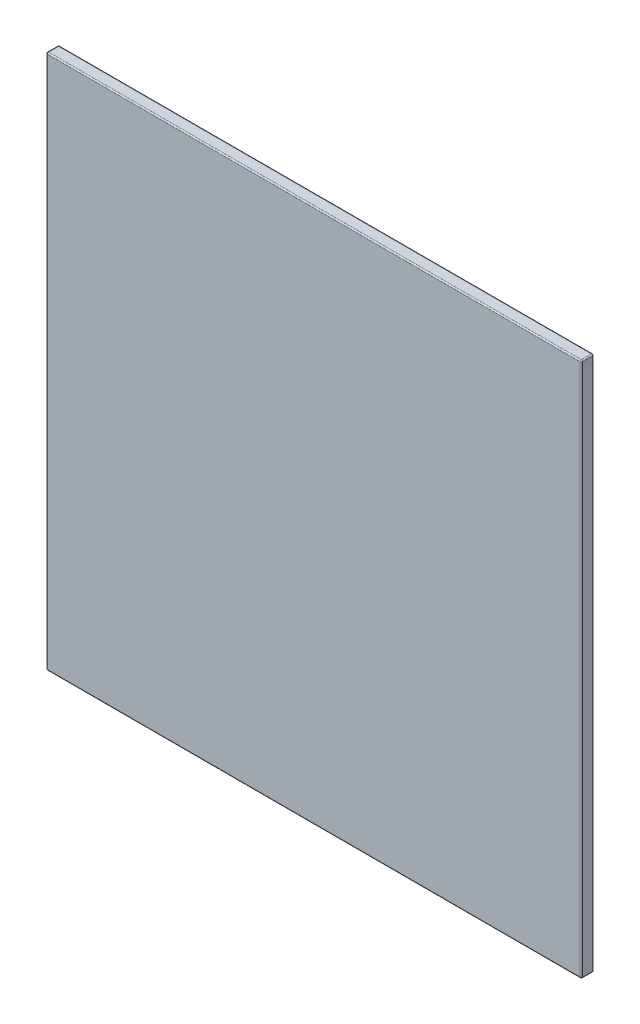
ISO-10303-21;
HEADER;
FILE_DESCRIPTION(('STEP AP214'),'2;1');
FILE_NAME('part.step','',(''),(''),'','','');
FILE_SCHEMA(('AUTOMOTIVE_DESIGN { 1 0 10303 214 1 1 1 1 }'));
ENDSEC;
DATA;
#1=APPLICATION_CONTEXT('core data for automotive mechanical design processes');
#2=APPLICATION_PROTOCOL_DEFINITION('international standard','automotive_design',2000,#1);
#3=PRODUCT_CONTEXT('',#1,'mechanical');
#4=PRODUCT('Part','Part','',(#3));
#5=PRODUCT_RELATED_PRODUCT_CATEGORY('part','',(#4));
#6=PRODUCT_DEFINITION_FORMATION('','',#4);
#7=PRODUCT_DEFINITION_CONTEXT('part definition',#1,'design');
#8=PRODUCT_DEFINITION('design','',#6,#7);
#9=PRODUCT_DEFINITION_SHAPE('','',#8);
#10=(LENGTH_UNIT() NAMED_UNIT(*) SI_UNIT(.MILLI.,.METRE.));
#11=(NAMED_UNIT(*) PLANE_ANGLE_UNIT() SI_UNIT($,.RADIAN.));
#12=(NAMED_UNIT(*) SI_UNIT($,.STERADIAN.) SOLID_ANGLE_UNIT());
#13=UNCERTAINTY_MEASURE_WITH_UNIT(LENGTH_MEASURE(1.E-05),#10,'distance_accuracy_value','');
#14=(GEOMETRIC_REPRESENTATION_CONTEXT(3) GLOBAL_UNCERTAINTY_ASSIGNED_CONTEXT((#13)) GLOBAL_UNIT_ASSIGNED_CONTEXT((#10,
#11,#12)) REPRESENTATION_CONTEXT('',''));
#15=CARTESIAN_POINT('',(0.,0.,0.));
#16=DIRECTION('',(0.,0.,1.));
#17=DIRECTION('',(1.,0.,0.));
#18=AXIS2_PLACEMENT_3D('',#15,#16,#17);
#19=CARTESIAN_POINT('',(126.708074534162,233.385093167702,7.));
#20=DIRECTION('',(-1.,0.,0.));
#21=DIRECTION('',(0.,-1.,0.));
#22=AXIS2_PLACEMENT_3D('',#19,#20,#21);
#23=PLANE('',#22);
#24=DIRECTION('',(0.,1.,0.));
#25=VECTOR('',#24,1.);
#26=CARTESIAN_POINT('',(126.708074534162,233.385093167702,0.7));
#27=LINE('',#26,#25);
#28=CARTESIAN_POINT('',(126.708074534162,-65.9149068322982,0.7));
#29=VERTEX_POINT('',#28);
#30=CARTESIAN_POINT('',(126.708074534162,232.685093167702,0.7));
#31=VERTEX_POINT('',#30);
#32=EDGE_CURVE('E166',#29,#31,#27,.T.);
#33=ORIENTED_EDGE('',*,*,#32,.T.);
#34=DIRECTION('',(0.,0.,-1.));
#35=VECTOR('',#34,1.);
#36=CARTESIAN_POINT('',(126.708074534162,232.685093167702,7.));
#37=LINE('',#36,#35);
#38=CARTESIAN_POINT('',(126.708074534162,232.685093167702,6.3));
#39=VERTEX_POINT('',#38);
#40=EDGE_CURVE('E130',#31,#39,#37,.F.);
#41=ORIENTED_EDGE('',*,*,#40,.T.);
#42=DIRECTION('',(0.,1.,0.));
#43=VECTOR('',#42,1.);
#44=CARTESIAN_POINT('',(126.708074534162,-66.6149068322982,6.3));
#45=LINE('',#44,#43);
#46=CARTESIAN_POINT('',(126.708074534162,-65.9149068322982,6.3));
#47=VERTEX_POINT('',#46);
#48=EDGE_CURVE('E164',#39,#47,#45,.F.);
#49=ORIENTED_EDGE('',*,*,#48,.T.);
#50=DIRECTION('',(0.,0.,-1.));
#51=VECTOR('',#50,1.);
#52=CARTESIAN_POINT('',(126.708074534162,-65.9149068322982,7.));
#53=LINE('',#52,#51);
#54=EDGE_CURVE('E159',#47,#29,#53,.T.);
#55=ORIENTED_EDGE('',*,*,#54,.T.);
#56=EDGE_LOOP('',(#33,#41,#49,#55));
#57=FACE_BOUND('',#56,.T.);
#58=ADVANCED_FACE('F34',(#57),#23,.F.);
#59=CARTESIAN_POINT('',(-173.291925465838,233.385093167702,7.));
#60=DIRECTION('',(0.,-1.,0.));
#61=DIRECTION('',(0.,0.,-1.));
#62=AXIS2_PLACEMENT_3D('',#59,#60,#61);
#63=PLANE('',#62);
#64=DIRECTION('',(0.,0.,-1.));
#65=VECTOR('',#64,1.);
#66=CARTESIAN_POINT('',(-172.591925465838,233.385093167702,7.));
#67=LINE('',#66,#65);
#68=CARTESIAN_POINT('',(-172.591925465838,233.385093167702,0.7));
#69=VERTEX_POINT('',#68);
#70=CARTESIAN_POINT('',(-172.591925465838,233.385093167702,6.3));
#71=VERTEX_POINT('',#70);
#72=EDGE_CURVE('E152',#69,#71,#67,.F.);
#73=ORIENTED_EDGE('',*,*,#72,.T.);
#74=DIRECTION('',(-1.,0.,0.));
#75=VECTOR('',#74,1.);
#76=CARTESIAN_POINT('',(126.708074534162,233.385093167702,6.3));
#77=LINE('',#76,#75);
#78=CARTESIAN_POINT('',(126.008074534162,233.385093167702,6.3));
#79=VERTEX_POINT('',#78);
#80=EDGE_CURVE('E156',#71,#79,#77,.F.);
#81=ORIENTED_EDGE('',*,*,#80,.T.);
#82=DIRECTION('',(0.,0.,-1.));
#83=VECTOR('',#82,1.);
#84=CARTESIAN_POINT('',(126.008074534162,233.385093167702,7.));
#85=LINE('',#84,#83);
#86=CARTESIAN_POINT('',(126.008074534162,233.385093167702,0.7));
#87=VERTEX_POINT('',#86);
#88=EDGE_CURVE('E128',#79,#87,#85,.T.);
#89=ORIENTED_EDGE('',*,*,#88,.T.);
#90=DIRECTION('',(-1.,0.,0.));
#91=VECTOR('',#90,1.);
#92=CARTESIAN_POINT('',(-173.291925465838,233.385093167702,0.7));
#93=LINE('',#92,#91);
#94=EDGE_CURVE('E146',#87,#69,#93,.T.);
#95=ORIENTED_EDGE('',*,*,#94,.T.);
#96=EDGE_LOOP('',(#73,#81,#89,#95));
#97=FACE_BOUND('',#96,.T.);
#98=ADVANCED_FACE('F154',(#97),#63,.F.);
#99=CARTESIAN_POINT('',(-173.291925465838,233.385093167702,7.));
#100=DIRECTION('',(1.,0.,0.));
#101=DIRECTION('',(0.,1.,0.));
#102=AXIS2_PLACEMENT_3D('',#99,#100,#101);
#103=PLANE('',#102);
#104=DIRECTION('',(0.,0.,-1.));
#105=VECTOR('',#104,1.);
#106=CARTESIAN_POINT('',(-173.291925465838,-65.9149068322982,7.));
#107=LINE('',#106,#105);
#108=CARTESIAN_POINT('',(-173.291925465838,-65.9149068322982,0.7));
#109=VERTEX_POINT('',#108);
#110=CARTESIAN_POINT('',(-173.291925465838,-65.9149068322982,6.3));
#111=VERTEX_POINT('',#110);
#112=EDGE_CURVE('E43',#109,#111,#107,.F.);
#113=ORIENTED_EDGE('',*,*,#112,.T.);
#114=DIRECTION('',(0.,-1.,0.));
#115=VECTOR('',#114,1.);
#116=CARTESIAN_POINT('',(-173.291925465838,233.385093167702,6.3));
#117=LINE('',#116,#115);
#118=CARTESIAN_POINT('',(-173.291925465838,232.685093167702,6.3));
#119=VERTEX_POINT('',#118);
#120=EDGE_CURVE('E11',#111,#119,#117,.F.);
#121=ORIENTED_EDGE('',*,*,#120,.T.);
#122=DIRECTION('',(0.,0.,-1.));
#123=VECTOR('',#122,1.);
#124=CARTESIAN_POINT('',(-173.291925465838,232.685093167702,7.));
#125=LINE('',#124,#123);
#126=CARTESIAN_POINT('',(-173.291925465838,232.685093167702,0.7));
#127=VERTEX_POINT('',#126);
#128=EDGE_CURVE('E198',#119,#127,#125,.T.);
#129=ORIENTED_EDGE('',*,*,#128,.T.);
#130=DIRECTION('',(0.,-1.,0.));
#131=VECTOR('',#130,1.);
#132=CARTESIAN_POINT('',(-173.291925465838,233.385093167702,0.7));
#133=LINE('',#132,#131);
#134=EDGE_CURVE('E196',#127,#109,#133,.T.);
#135=ORIENTED_EDGE('',*,*,#134,.T.);
#136=EDGE_LOOP('',(#113,#121,#129,#135));
#137=FACE_BOUND('',#136,.T.);
#138=ADVANCED_FACE('F293',(#137),#103,.F.);
#139=CARTESIAN_POINT('',(-173.291925465838,-66.6149068322982,7.));
#140=DIRECTION('',(0.,1.,0.));
#141=DIRECTION('',(0.,0.,1.));
#142=AXIS2_PLACEMENT_3D('',#139,#140,#141);
#143=PLANE('',#142);
#144=DIRECTION('',(1.,0.,0.));
#145=VECTOR('',#144,1.);
#146=CARTESIAN_POINT('',(-173.291925465838,-66.6149068322982,0.7));
#147=LINE('',#146,#145);
#148=CARTESIAN_POINT('',(-172.591925465838,-66.6149068322982,0.7));
#149=VERTEX_POINT('',#148);
#150=CARTESIAN_POINT('',(126.008074534162,-66.6149068322982,0.7));
#151=VERTEX_POINT('',#150);
#152=EDGE_CURVE('E191',#149,#151,#147,.T.);
#153=ORIENTED_EDGE('',*,*,#152,.T.);
#154=DIRECTION('',(0.,0.,-1.));
#155=VECTOR('',#154,1.);
#156=CARTESIAN_POINT('',(126.008074534162,-66.6149068322982,7.));
#157=LINE('',#156,#155);
#158=CARTESIAN_POINT('',(126.008074534162,-66.6149068322982,6.3));
#159=VERTEX_POINT('',#158);
#160=EDGE_CURVE('E193',#151,#159,#157,.F.);
#161=ORIENTED_EDGE('',*,*,#160,.T.);
#162=DIRECTION('',(1.,0.,0.));
#163=VECTOR('',#162,1.);
#164=CARTESIAN_POINT('',(-173.291925465838,-66.6149068322982,6.3));
#165=LINE('',#164,#163);
#166=CARTESIAN_POINT('',(-172.591925465838,-66.6149068322982,6.3));
#167=VERTEX_POINT('',#166);
#168=EDGE_CURVE('E189',#159,#167,#165,.F.);
#169=ORIENTED_EDGE('',*,*,#168,.T.);
#170=DIRECTION('',(0.,0.,-1.));
#171=VECTOR('',#170,1.);
#172=CARTESIAN_POINT('',(-172.591925465838,-66.6149068322982,7.));
#173=LINE('',#172,#171);
#174=EDGE_CURVE('E187',#167,#149,#173,.T.);
#175=ORIENTED_EDGE('',*,*,#174,.T.);
#176=EDGE_LOOP('',(#153,#161,#169,#175));
#177=FACE_BOUND('',#176,.T.);
#178=ADVANCED_FACE('F356',(#177),#143,.F.);
#179=CARTESIAN_POINT('',(0.,0.,7.));
#180=DIRECTION('',(0.,0.,1.));
#181=DIRECTION('',(1.,0.,0.));
#182=AXIS2_PLACEMENT_3D('',#179,#180,#181);
#183=PLANE('',#182);
#184=DIRECTION('',(1.,0.,0.));
#185=VECTOR('',#184,1.);
#186=CARTESIAN_POINT('',(126.708074534162,-65.9149068322982,7.));
#187=LINE('',#186,#185);
#188=CARTESIAN_POINT('',(-172.591925465838,-65.9149068322982,7.));
#189=VERTEX_POINT('',#188);
#190=CARTESIAN_POINT('',(126.008074534162,-65.9149068322982,7.));
#191=VERTEX_POINT('',#190);
#192=EDGE_CURVE('E182',#189,#191,#187,.T.);
#193=ORIENTED_EDGE('',*,*,#192,.T.);
#194=DIRECTION('',(0.,1.,0.));
#195=VECTOR('',#194,1.);
#196=CARTESIAN_POINT('',(126.008074534162,233.385093167702,7.));
#197=LINE('',#196,#195);
#198=CARTESIAN_POINT('',(126.008074534162,232.685093167702,7.));
#199=VERTEX_POINT('',#198);
#200=EDGE_CURVE('E184',#191,#199,#197,.T.);
#201=ORIENTED_EDGE('',*,*,#200,.T.);
#202=DIRECTION('',(-1.,0.,0.));
#203=VECTOR('',#202,1.);
#204=CARTESIAN_POINT('',(-173.291925465838,232.685093167702,7.));
#205=LINE('',#204,#203);
#206=CARTESIAN_POINT('',(-172.591925465838,232.685093167702,7.));
#207=VERTEX_POINT('',#206);
#208=EDGE_CURVE('E178',#199,#207,#205,.T.);
#209=ORIENTED_EDGE('',*,*,#208,.T.);
#210=DIRECTION('',(0.,-1.,0.));
#211=VECTOR('',#210,1.);
#212=CARTESIAN_POINT('',(-172.591925465838,-66.6149068322982,7.));
#213=LINE('',#212,#211);
#214=EDGE_CURVE('E180',#207,#189,#213,.T.);
#215=ORIENTED_EDGE('',*,*,#214,.T.);
#216=EDGE_LOOP('',(#193,#201,#209,#215));
#217=FACE_BOUND('',#216,.T.);
#218=ADVANCED_FACE('F270',(#217),#183,.T.);
#219=CARTESIAN_POINT('',(0.,0.,0.));
#220=DIRECTION('',(0.,0.,1.));
#221=DIRECTION('',(1.,0.,0.));
#222=AXIS2_PLACEMENT_3D('',#219,#220,#221);
#223=PLANE('',#222);
#224=DIRECTION('',(-1.,0.,0.));
#225=VECTOR('',#224,1.);
#226=CARTESIAN_POINT('',(0.,232.685093167702,0.));
#227=LINE('',#226,#225);
#228=CARTESIAN_POINT('',(-172.591925465838,232.685093167702,0.));
#229=VERTEX_POINT('',#228);
#230=CARTESIAN_POINT('',(126.008074534162,232.685093167702,0.));
#231=VERTEX_POINT('',#230);
#232=EDGE_CURVE('E169',#229,#231,#227,.F.);
#233=ORIENTED_EDGE('',*,*,#232,.T.);
#234=DIRECTION('',(0.,1.,0.));
#235=VECTOR('',#234,1.);
#236=CARTESIAN_POINT('',(126.008074534162,0.,0.));
#237=LINE('',#236,#235);
#238=CARTESIAN_POINT('',(126.008074534162,-65.9149068322982,0.));
#239=VERTEX_POINT('',#238);
#240=EDGE_CURVE('E175',#231,#239,#237,.F.);
#241=ORIENTED_EDGE('',*,*,#240,.T.);
#242=DIRECTION('',(1.,0.,0.));
#243=VECTOR('',#242,1.);
#244=CARTESIAN_POINT('',(0.,-65.9149068322982,0.));
#245=LINE('',#244,#243);
#246=CARTESIAN_POINT('',(-172.591925465838,-65.9149068322982,0.));
#247=VERTEX_POINT('',#246);
#248=EDGE_CURVE('E173',#239,#247,#245,.F.);
#249=ORIENTED_EDGE('',*,*,#248,.T.);
#250=DIRECTION('',(0.,-1.,0.));
#251=VECTOR('',#250,1.);
#252=CARTESIAN_POINT('',(-172.591925465838,0.,0.));
#253=LINE('',#252,#251);
#254=EDGE_CURVE('E171',#247,#229,#253,.F.);
#255=ORIENTED_EDGE('',*,*,#254,.T.);
#256=EDGE_LOOP('',(#233,#241,#249,#255));
#257=FACE_BOUND('',#256,.T.);
#258=ADVANCED_FACE('F367',(#257),#223,.F.);
#259=CARTESIAN_POINT('',(-172.591925465838,-65.9149068322982,7.));
#260=DIRECTION('',(0.,0.,-1.));
#261=DIRECTION('',(-1.,0.,0.));
#262=AXIS2_PLACEMENT_3D('',#259,#260,#261);
#263=CYLINDRICAL_SURFACE('',#262,0.7);
#264=CARTESIAN_POINT('',(-172.591925465838,-65.9149068322982,6.3));
#265=DIRECTION('',(0.,0.,1.));
#266=DIRECTION('',(1.,0.,0.));
#267=AXIS2_PLACEMENT_3D('',#264,#265,#266);
#268=CIRCLE('',#267,0.7);
#269=EDGE_CURVE('E38',#111,#167,#268,.T.);
#270=ORIENTED_EDGE('',*,*,#269,.F.);
#271=ORIENTED_EDGE('',*,*,#112,.F.);
#272=CARTESIAN_POINT('',(-172.591925465838,-65.9149068322982,0.7));
#273=DIRECTION('',(0.,0.,-1.));
#274=DIRECTION('',(-1.,0.,0.));
#275=AXIS2_PLACEMENT_3D('',#272,#273,#274);
#276=CIRCLE('',#275,0.7);
#277=EDGE_CURVE('E249',#149,#109,#276,.T.);
#278=ORIENTED_EDGE('',*,*,#277,.F.);
#279=ORIENTED_EDGE('',*,*,#174,.F.);
#280=EDGE_LOOP('',(#270,#271,#278,#279));
#281=FACE_BOUND('',#280,.T.);
#282=ADVANCED_FACE('F36',(#281),#263,.T.);
#283=CARTESIAN_POINT('',(-172.591925465838,-65.9149068322982,6.3));
#284=DIRECTION('',(0.,0.,1.));
#285=DIRECTION('',(1.,0.,0.));
#286=AXIS2_PLACEMENT_3D('',#283,#284,#285);
#287=SPHERICAL_SURFACE('',#286,0.7);
#288=CARTESIAN_POINT('',(-172.591925465838,-65.9149068322982,6.3));
#289=DIRECTION('',(0.,-1.,0.));
#290=DIRECTION('',(0.,0.,-1.));
#291=AXIS2_PLACEMENT_3D('',#288,#289,#290);
#292=CIRCLE('',#291,0.7);
#293=EDGE_CURVE('E245',#111,#189,#292,.F.);
#294=ORIENTED_EDGE('',*,*,#293,.F.);
#295=ORIENTED_EDGE('',*,*,#269,.T.);
#296=CARTESIAN_POINT('',(-172.591925465838,-65.9149068322982,6.3));
#297=DIRECTION('',(-1.,0.,0.));
#298=DIRECTION('',(0.,0.,1.));
#299=AXIS2_PLACEMENT_3D('',#296,#297,#298);
#300=CIRCLE('',#299,0.7);
#301=EDGE_CURVE('E247',#189,#167,#300,.F.);
#302=ORIENTED_EDGE('',*,*,#301,.F.);
#303=EDGE_LOOP('',(#294,#295,#302));
#304=FACE_BOUND('',#303,.T.);
#305=ADVANCED_FACE('F259',(#304),#287,.T.);
#306=CARTESIAN_POINT('',(-172.591925465838,-65.9149068322982,0.7));
#307=DIRECTION('',(0.,0.,1.));
#308=DIRECTION('',(1.,0.,0.));
#309=AXIS2_PLACEMENT_3D('',#306,#307,#308);
#310=SPHERICAL_SURFACE('',#309,0.7);
#311=CARTESIAN_POINT('',(-172.591925465838,-65.9149068322982,0.7));
#312=DIRECTION('',(-1.,0.,0.));
#313=DIRECTION('',(0.,0.,1.));
#314=AXIS2_PLACEMENT_3D('',#311,#312,#313);
#315=CIRCLE('',#314,0.7);
#316=EDGE_CURVE('E239',#149,#247,#315,.F.);
#317=ORIENTED_EDGE('',*,*,#316,.F.);
#318=ORIENTED_EDGE('',*,*,#277,.T.);
#319=CARTESIAN_POINT('',(-172.591925465838,-65.9149068322982,0.7));
#320=DIRECTION('',(0.,-1.,0.));
#321=DIRECTION('',(0.,0.,-1.));
#322=AXIS2_PLACEMENT_3D('',#319,#320,#321);
#323=CIRCLE('',#322,0.7);
#324=EDGE_CURVE('E242',#247,#109,#323,.F.);
#325=ORIENTED_EDGE('',*,*,#324,.F.);
#326=EDGE_LOOP('',(#317,#318,#325));
#327=FACE_BOUND('',#326,.T.);
#328=ADVANCED_FACE('F285',(#327),#310,.T.);
#329=CARTESIAN_POINT('',(0.,-65.9149068322982,6.3));
#330=DIRECTION('',(-1.,0.,0.));
#331=DIRECTION('',(0.,0.,1.));
#332=AXIS2_PLACEMENT_3D('',#329,#330,#331);
#333=CYLINDRICAL_SURFACE('',#332,0.7);
#334=ORIENTED_EDGE('',*,*,#301,.T.);
#335=ORIENTED_EDGE('',*,*,#168,.F.);
#336=CARTESIAN_POINT('',(126.008074534162,-65.9149068322982,6.3));
#337=DIRECTION('',(1.,0.,0.));
#338=DIRECTION('',(0.,0.,-1.));
#339=AXIS2_PLACEMENT_3D('',#336,#337,#338);
#340=CIRCLE('',#339,0.7);
#341=EDGE_CURVE('E234',#191,#159,#340,.T.);
#342=ORIENTED_EDGE('',*,*,#341,.F.);
#343=ORIENTED_EDGE('',*,*,#192,.F.);
#344=EDGE_LOOP('',(#334,#335,#342,#343));
#345=FACE_BOUND('',#344,.T.);
#346=ADVANCED_FACE('F266',(#345),#333,.T.);
#347=CARTESIAN_POINT('',(-172.591925465838,0.,6.3));
#348=DIRECTION('',(0.,1.,0.));
#349=DIRECTION('',(-1.,0.,0.));
#350=AXIS2_PLACEMENT_3D('',#347,#348,#349);
#351=CYLINDRICAL_SURFACE('',#350,0.7);
#352=ORIENTED_EDGE('',*,*,#293,.T.);
#353=ORIENTED_EDGE('',*,*,#214,.F.);
#354=CARTESIAN_POINT('',(-172.591925465838,232.685093167702,6.3));
#355=DIRECTION('',(0.,1.,0.));
#356=DIRECTION('',(0.,0.,1.));
#357=AXIS2_PLACEMENT_3D('',#354,#355,#356);
#358=CIRCLE('',#357,0.7);
#359=EDGE_CURVE('E231',#119,#207,#358,.T.);
#360=ORIENTED_EDGE('',*,*,#359,.F.);
#361=ORIENTED_EDGE('',*,*,#120,.F.);
#362=EDGE_LOOP('',(#352,#353,#360,#361));
#363=FACE_BOUND('',#362,.T.);
#364=ADVANCED_FACE('F274',(#363),#351,.T.);
#365=CARTESIAN_POINT('',(-172.591925465838,232.685093167702,7.));
#366=DIRECTION('',(0.,0.,-1.));
#367=DIRECTION('',(-1.,0.,0.));
#368=AXIS2_PLACEMENT_3D('',#365,#366,#367);
#369=CYLINDRICAL_SURFACE('',#368,0.7);
#370=CARTESIAN_POINT('',(-172.591925465838,232.685093167702,0.7));
#371=DIRECTION('',(0.,0.,-1.));
#372=DIRECTION('',(-1.,0.,0.));
#373=AXIS2_PLACEMENT_3D('',#370,#371,#372);
#374=CIRCLE('',#373,0.7);
#375=EDGE_CURVE('E225',#127,#69,#374,.T.);
#376=ORIENTED_EDGE('',*,*,#375,.F.);
#377=ORIENTED_EDGE('',*,*,#128,.F.);
#378=CARTESIAN_POINT('',(-172.591925465838,232.685093167702,6.3));
#379=DIRECTION('',(0.,0.,1.));
#380=DIRECTION('',(1.,0.,0.));
#381=AXIS2_PLACEMENT_3D('',#378,#379,#380);
#382=CIRCLE('',#381,0.7);
#383=EDGE_CURVE('E228',#71,#119,#382,.T.);
#384=ORIENTED_EDGE('',*,*,#383,.F.);
#385=ORIENTED_EDGE('',*,*,#72,.F.);
#386=EDGE_LOOP('',(#376,#377,#384,#385));
#387=FACE_BOUND('',#386,.T.);
#388=ADVANCED_FACE('F276',(#387),#369,.T.);
#389=CARTESIAN_POINT('',(-172.591925465838,233.385093167702,0.7));
#390=DIRECTION('',(0.,-1.,0.));
#391=DIRECTION('',(1.,0.,0.));
#392=AXIS2_PLACEMENT_3D('',#389,#390,#391);
#393=CYLINDRICAL_SURFACE('',#392,0.7);
#394=ORIENTED_EDGE('',*,*,#324,.T.);
#395=ORIENTED_EDGE('',*,*,#134,.F.);
#396=CARTESIAN_POINT('',(-172.591925465838,232.685093167702,0.7));
#397=DIRECTION('',(0.,1.,0.));
#398=DIRECTION('',(0.,0.,1.));
#399=AXIS2_PLACEMENT_3D('',#396,#397,#398);
#400=CIRCLE('',#399,0.7);
#401=EDGE_CURVE('E222',#229,#127,#400,.T.);
#402=ORIENTED_EDGE('',*,*,#401,.F.);
#403=ORIENTED_EDGE('',*,*,#254,.F.);
#404=EDGE_LOOP('',(#394,#395,#402,#403));
#405=FACE_BOUND('',#404,.T.);
#406=ADVANCED_FACE('F282',(#405),#393,.T.);
#407=CARTESIAN_POINT('',(-173.291925465838,-65.9149068322982,0.7));
#408=DIRECTION('',(1.,0.,0.));
#409=DIRECTION('',(0.,0.,-1.));
#410=AXIS2_PLACEMENT_3D('',#407,#408,#409);
#411=CYLINDRICAL_SURFACE('',#410,0.7);
#412=ORIENTED_EDGE('',*,*,#316,.T.);
#413=ORIENTED_EDGE('',*,*,#248,.F.);
#414=CARTESIAN_POINT('',(126.008074534162,-65.9149068322982,0.7));
#415=DIRECTION('',(1.,0.,0.));
#416=DIRECTION('',(0.,0.,-1.));
#417=AXIS2_PLACEMENT_3D('',#414,#415,#416);
#418=CIRCLE('',#417,0.7);
#419=EDGE_CURVE('E219',#151,#239,#418,.T.);
#420=ORIENTED_EDGE('',*,*,#419,.F.);
#421=ORIENTED_EDGE('',*,*,#152,.F.);
#422=EDGE_LOOP('',(#412,#413,#420,#421));
#423=FACE_BOUND('',#422,.T.);
#424=ADVANCED_FACE('F338',(#423),#411,.T.);
#425=CARTESIAN_POINT('',(126.008074534162,-65.9149068322982,7.));
#426=DIRECTION('',(0.,0.,-1.));
#427=DIRECTION('',(-1.,0.,0.));
#428=AXIS2_PLACEMENT_3D('',#425,#426,#427);
#429=CYLINDRICAL_SURFACE('',#428,0.7);
#430=CARTESIAN_POINT('',(126.008074534162,-65.9149068322982,6.3));
#431=DIRECTION('',(0.,0.,1.));
#432=DIRECTION('',(1.,0.,0.));
#433=AXIS2_PLACEMENT_3D('',#430,#431,#432);
#434=CIRCLE('',#433,0.7);
#435=EDGE_CURVE('E236',#159,#47,#434,.T.);
#436=ORIENTED_EDGE('',*,*,#435,.F.);
#437=ORIENTED_EDGE('',*,*,#160,.F.);
#438=CARTESIAN_POINT('',(126.008074534162,-65.9149068322982,0.7));
#439=DIRECTION('',(0.,0.,-1.));
#440=DIRECTION('',(-1.,0.,0.));
#441=AXIS2_PLACEMENT_3D('',#438,#439,#440);
#442=CIRCLE('',#441,0.7);
#443=EDGE_CURVE('E216',#29,#151,#442,.T.);
#444=ORIENTED_EDGE('',*,*,#443,.F.);
#445=ORIENTED_EDGE('',*,*,#54,.F.);
#446=EDGE_LOOP('',(#436,#437,#444,#445));
#447=FACE_BOUND('',#446,.T.);
#448=ADVANCED_FACE('F334',(#447),#429,.T.);
#449=CARTESIAN_POINT('',(126.008074534162,-65.9149068322982,6.3));
#450=DIRECTION('',(0.,0.,1.));
#451=DIRECTION('',(1.,0.,0.));
#452=AXIS2_PLACEMENT_3D('',#449,#450,#451);
#453=SPHERICAL_SURFACE('',#452,0.7);
#454=ORIENTED_EDGE('',*,*,#341,.T.);
#455=ORIENTED_EDGE('',*,*,#435,.T.);
#456=CARTESIAN_POINT('',(126.008074534162,-65.9149068322982,6.3));
#457=DIRECTION('',(0.,-1.,0.));
#458=DIRECTION('',(0.,0.,-1.));
#459=AXIS2_PLACEMENT_3D('',#456,#457,#458);
#460=CIRCLE('',#459,0.7);
#461=EDGE_CURVE('E213',#191,#47,#460,.F.);
#462=ORIENTED_EDGE('',*,*,#461,.F.);
#463=EDGE_LOOP('',(#454,#455,#462));
#464=FACE_BOUND('',#463,.T.);
#465=ADVANCED_FACE('F330',(#464),#453,.T.);
#466=CARTESIAN_POINT('',(-172.591925465838,232.685093167702,6.3));
#467=DIRECTION('',(0.,0.,1.));
#468=DIRECTION('',(1.,0.,0.));
#469=AXIS2_PLACEMENT_3D('',#466,#467,#468);
#470=SPHERICAL_SURFACE('',#469,0.7);
#471=ORIENTED_EDGE('',*,*,#383,.T.);
#472=ORIENTED_EDGE('',*,*,#359,.T.);
#473=CARTESIAN_POINT('',(-172.591925465838,232.685093167702,6.3));
#474=DIRECTION('',(-1.,0.,0.));
#475=DIRECTION('',(0.,0.,1.));
#476=AXIS2_PLACEMENT_3D('',#473,#474,#475);
#477=CIRCLE('',#476,0.7);
#478=EDGE_CURVE('E210',#71,#207,#477,.F.);
#479=ORIENTED_EDGE('',*,*,#478,.F.);
#480=EDGE_LOOP('',(#471,#472,#479));
#481=FACE_BOUND('',#480,.T.);
#482=ADVANCED_FACE('F326',(#481),#470,.T.);
#483=CARTESIAN_POINT('',(-172.591925465838,232.685093167702,0.7));
#484=DIRECTION('',(0.,0.,1.));
#485=DIRECTION('',(1.,0.,0.));
#486=AXIS2_PLACEMENT_3D('',#483,#484,#485);
#487=SPHERICAL_SURFACE('',#486,0.7);
#488=ORIENTED_EDGE('',*,*,#401,.T.);
#489=ORIENTED_EDGE('',*,*,#375,.T.);
#490=CARTESIAN_POINT('',(-172.591925465838,232.685093167702,0.7));
#491=DIRECTION('',(-1.,0.,0.));
#492=DIRECTION('',(0.,0.,1.));
#493=AXIS2_PLACEMENT_3D('',#490,#491,#492);
#494=CIRCLE('',#493,0.7);
#495=EDGE_CURVE('E149',#229,#69,#494,.F.);
#496=ORIENTED_EDGE('',*,*,#495,.F.);
#497=EDGE_LOOP('',(#488,#489,#496));
#498=FACE_BOUND('',#497,.T.);
#499=ADVANCED_FACE('F322',(#498),#487,.T.);
#500=CARTESIAN_POINT('',(126.008074534162,-65.9149068322982,0.7));
#501=DIRECTION('',(0.,0.,1.));
#502=DIRECTION('',(1.,0.,0.));
#503=AXIS2_PLACEMENT_3D('',#500,#501,#502);
#504=SPHERICAL_SURFACE('',#503,0.7);
#505=ORIENTED_EDGE('',*,*,#443,.T.);
#506=ORIENTED_EDGE('',*,*,#419,.T.);
#507=CARTESIAN_POINT('',(126.008074534162,-65.9149068322982,0.7));
#508=DIRECTION('',(0.,-1.,0.));
#509=DIRECTION('',(1.,0.,0.));
#510=AXIS2_PLACEMENT_3D('',#507,#508,#509);
#511=CIRCLE('',#510,0.7);
#512=EDGE_CURVE('E207',#29,#239,#511,.F.);
#513=ORIENTED_EDGE('',*,*,#512,.F.);
#514=EDGE_LOOP('',(#505,#506,#513));
#515=FACE_BOUND('',#514,.T.);
#516=ADVANCED_FACE('F318',(#515),#504,.T.);
#517=CARTESIAN_POINT('',(126.008074534162,0.,6.3));
#518=DIRECTION('',(0.,-1.,0.));
#519=DIRECTION('',(1.,0.,0.));
#520=AXIS2_PLACEMENT_3D('',#517,#518,#519);
#521=CYLINDRICAL_SURFACE('',#520,0.7);
#522=ORIENTED_EDGE('',*,*,#461,.T.);
#523=ORIENTED_EDGE('',*,*,#48,.F.);
#524=CARTESIAN_POINT('',(126.008074534162,232.685093167702,6.3));
#525=DIRECTION('',(0.,1.,0.));
#526=DIRECTION('',(0.,0.,1.));
#527=AXIS2_PLACEMENT_3D('',#524,#525,#526);
#528=CIRCLE('',#527,0.7);
#529=EDGE_CURVE('E204',#199,#39,#528,.T.);
#530=ORIENTED_EDGE('',*,*,#529,.F.);
#531=ORIENTED_EDGE('',*,*,#200,.F.);
#532=EDGE_LOOP('',(#522,#523,#530,#531));
#533=FACE_BOUND('',#532,.T.);
#534=ADVANCED_FACE('F314',(#533),#521,.T.);
#535=CARTESIAN_POINT('',(0.,232.685093167702,6.3));
#536=DIRECTION('',(1.,0.,0.));
#537=DIRECTION('',(0.,0.,-1.));
#538=AXIS2_PLACEMENT_3D('',#535,#536,#537);
#539=CYLINDRICAL_SURFACE('',#538,0.7);
#540=ORIENTED_EDGE('',*,*,#478,.T.);
#541=ORIENTED_EDGE('',*,*,#208,.F.);
#542=CARTESIAN_POINT('',(126.008074534162,232.685093167702,6.3));
#543=DIRECTION('',(1.,0.,0.));
#544=DIRECTION('',(0.,0.,-1.));
#545=AXIS2_PLACEMENT_3D('',#542,#543,#544);
#546=CIRCLE('',#545,0.7);
#547=EDGE_CURVE('E143',#79,#199,#546,.T.);
#548=ORIENTED_EDGE('',*,*,#547,.F.);
#549=ORIENTED_EDGE('',*,*,#80,.F.);
#550=EDGE_LOOP('',(#540,#541,#548,#549));
#551=FACE_BOUND('',#550,.T.);
#552=ADVANCED_FACE('F311',(#551),#539,.T.);
#553=CARTESIAN_POINT('',(-173.291925465838,232.685093167702,0.7));
#554=DIRECTION('',(-1.,0.,0.));
#555=DIRECTION('',(0.,0.,1.));
#556=AXIS2_PLACEMENT_3D('',#553,#554,#555);
#557=CYLINDRICAL_SURFACE('',#556,0.7);
#558=ORIENTED_EDGE('',*,*,#495,.T.);
#559=ORIENTED_EDGE('',*,*,#94,.F.);
#560=CARTESIAN_POINT('',(126.008074534162,232.685093167702,0.7));
#561=DIRECTION('',(1.,0.,0.));
#562=DIRECTION('',(0.,1.,0.));
#563=AXIS2_PLACEMENT_3D('',#560,#561,#562);
#564=CIRCLE('',#563,0.7);
#565=EDGE_CURVE('E136',#231,#87,#564,.T.);
#566=ORIENTED_EDGE('',*,*,#565,.F.);
#567=ORIENTED_EDGE('',*,*,#232,.F.);
#568=EDGE_LOOP('',(#558,#559,#566,#567));
#569=FACE_BOUND('',#568,.T.);
#570=ADVANCED_FACE('F147',(#569),#557,.T.);
#571=CARTESIAN_POINT('',(126.008074534162,233.385093167702,0.7));
#572=DIRECTION('',(0.,1.,0.));
#573=DIRECTION('',(-1.,0.,0.));
#574=AXIS2_PLACEMENT_3D('',#571,#572,#573);
#575=CYLINDRICAL_SURFACE('',#574,0.7);
#576=ORIENTED_EDGE('',*,*,#512,.T.);
#577=ORIENTED_EDGE('',*,*,#240,.F.);
#578=CARTESIAN_POINT('',(126.008074534162,232.685093167702,0.7));
#579=DIRECTION('',(0.,1.,0.));
#580=DIRECTION('',(0.,0.,1.));
#581=AXIS2_PLACEMENT_3D('',#578,#579,#580);
#582=CIRCLE('',#581,0.7);
#583=EDGE_CURVE('E140',#31,#231,#582,.T.);
#584=ORIENTED_EDGE('',*,*,#583,.F.);
#585=ORIENTED_EDGE('',*,*,#32,.F.);
#586=EDGE_LOOP('',(#576,#577,#584,#585));
#587=FACE_BOUND('',#586,.T.);
#588=ADVANCED_FACE('F304',(#587),#575,.T.);
#589=CARTESIAN_POINT('',(126.008074534162,232.685093167702,6.3));
#590=DIRECTION('',(0.,0.,1.));
#591=DIRECTION('',(1.,0.,0.));
#592=AXIS2_PLACEMENT_3D('',#589,#590,#591);
#593=SPHERICAL_SURFACE('',#592,0.7);
#594=ORIENTED_EDGE('',*,*,#547,.T.);
#595=ORIENTED_EDGE('',*,*,#529,.T.);
#596=CARTESIAN_POINT('',(126.008074534162,232.685093167702,6.3));
#597=DIRECTION('',(0.,0.,1.));
#598=DIRECTION('',(1.,0.,0.));
#599=AXIS2_PLACEMENT_3D('',#596,#597,#598);
#600=CIRCLE('',#599,0.7);
#601=EDGE_CURVE('E133',#79,#39,#600,.F.);
#602=ORIENTED_EDGE('',*,*,#601,.F.);
#603=EDGE_LOOP('',(#594,#595,#602));
#604=FACE_BOUND('',#603,.T.);
#605=ADVANCED_FACE('F301',(#604),#593,.T.);
#606=CARTESIAN_POINT('',(126.008074534162,232.685093167702,0.7));
#607=DIRECTION('',(0.,0.,1.));
#608=DIRECTION('',(1.,0.,0.));
#609=AXIS2_PLACEMENT_3D('',#606,#607,#608);
#610=SPHERICAL_SURFACE('',#609,0.7);
#611=ORIENTED_EDGE('',*,*,#583,.T.);
#612=ORIENTED_EDGE('',*,*,#565,.T.);
#613=CARTESIAN_POINT('',(126.008074534162,232.685093167702,0.7));
#614=DIRECTION('',(0.,0.,-1.));
#615=DIRECTION('',(-1.,0.,0.));
#616=AXIS2_PLACEMENT_3D('',#613,#614,#615);
#617=CIRCLE('',#616,0.7);
#618=EDGE_CURVE('E124',#31,#87,#617,.F.);
#619=ORIENTED_EDGE('',*,*,#618,.F.);
#620=EDGE_LOOP('',(#611,#612,#619));
#621=FACE_BOUND('',#620,.T.);
#622=ADVANCED_FACE('F138',(#621),#610,.T.);
#623=CARTESIAN_POINT('',(126.008074534162,232.685093167702,7.));
#624=DIRECTION('',(0.,0.,-1.));
#625=DIRECTION('',(-1.,0.,0.));
#626=AXIS2_PLACEMENT_3D('',#623,#624,#625);
#627=CYLINDRICAL_SURFACE('',#626,0.7);
#628=ORIENTED_EDGE('',*,*,#601,.T.);
#629=ORIENTED_EDGE('',*,*,#40,.F.);
#630=ORIENTED_EDGE('',*,*,#618,.T.);
#631=ORIENTED_EDGE('',*,*,#88,.F.);
#632=EDGE_LOOP('',(#628,#629,#630,#631));
#633=FACE_BOUND('',#632,.T.);
#634=ADVANCED_FACE('F126',(#633),#627,.T.);
#635=CLOSED_SHELL('',(#58,#98,#138,#178,#218,#258,#282,#305,#328,#346,#364,#388,#406,#424,#448,
#465,#482,#499,#516,#534,#552,#570,#588,#605,#622,#634));
#636=MANIFOLD_SOLID_BREP('B2',#635);
#637=ADVANCED_BREP_SHAPE_REPRESENTATION('',(#18,#636),#14);
#638=SHAPE_DEFINITION_REPRESENTATION(#9,#637);
ENDSEC;
END-ISO-10303-21;
